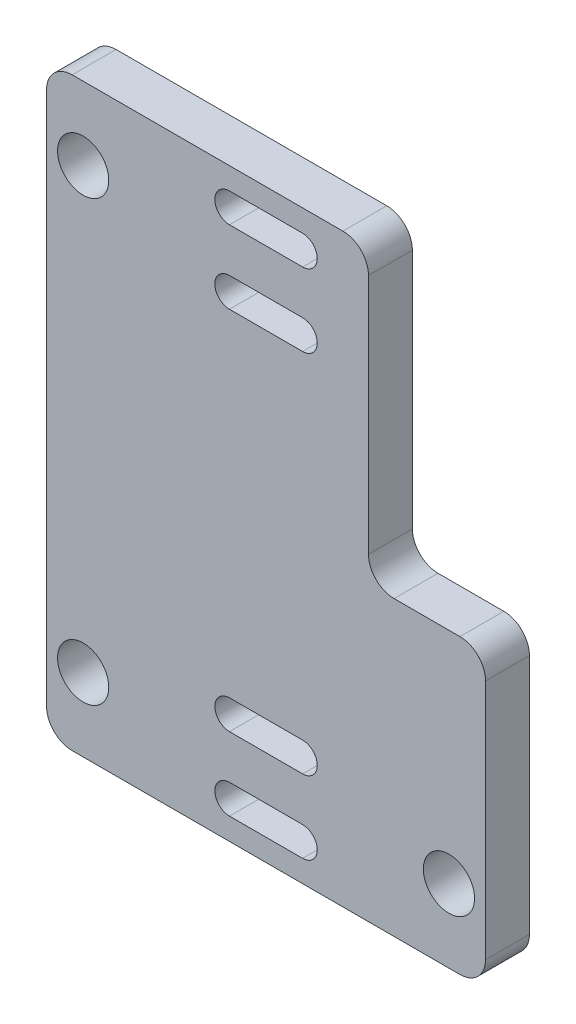
ISO-10303-21;
HEADER;
FILE_DESCRIPTION(('STEP AP214'),'2;1');
FILE_NAME('part.step','',(''),(''),'','','');
FILE_SCHEMA(('AUTOMOTIVE_DESIGN { 1 0 10303 214 1 1 1 1 }'));
ENDSEC;
DATA;
#1=APPLICATION_CONTEXT('core data for automotive mechanical design processes');
#2=APPLICATION_PROTOCOL_DEFINITION('international standard','automotive_design',2000,#1);
#3=PRODUCT_CONTEXT('',#1,'mechanical');
#4=PRODUCT('Part','Part','',(#3));
#5=PRODUCT_RELATED_PRODUCT_CATEGORY('part','',(#4));
#6=PRODUCT_DEFINITION_FORMATION('','',#4);
#7=PRODUCT_DEFINITION_CONTEXT('part definition',#1,'design');
#8=PRODUCT_DEFINITION('design','',#6,#7);
#9=PRODUCT_DEFINITION_SHAPE('','',#8);
#10=(LENGTH_UNIT() NAMED_UNIT(*) SI_UNIT(.MILLI.,.METRE.));
#11=(NAMED_UNIT(*) PLANE_ANGLE_UNIT() SI_UNIT($,.RADIAN.));
#12=(NAMED_UNIT(*) SI_UNIT($,.STERADIAN.) SOLID_ANGLE_UNIT());
#13=UNCERTAINTY_MEASURE_WITH_UNIT(LENGTH_MEASURE(1.E-05),#10,'distance_accuracy_value','');
#14=(GEOMETRIC_REPRESENTATION_CONTEXT(3) GLOBAL_UNCERTAINTY_ASSIGNED_CONTEXT((#13)) GLOBAL_UNIT_ASSIGNED_CONTEXT((#10,
#11,#12)) REPRESENTATION_CONTEXT('',''));
#15=CARTESIAN_POINT('',(0.,0.,0.));
#16=DIRECTION('',(0.,0.,1.));
#17=DIRECTION('',(1.,0.,0.));
#18=AXIS2_PLACEMENT_3D('',#15,#16,#17);
#19=CARTESIAN_POINT('',(0.,13.5,3.));
#20=DIRECTION('',(0.,1.,0.));
#21=DIRECTION('',(0.,0.,1.));
#22=AXIS2_PLACEMENT_3D('',#19,#20,#21);
#23=PLANE('',#22);
#24=DIRECTION('',(1.,0.,0.));
#25=VECTOR('',#24,1.);
#26=CARTESIAN_POINT('',(0.,13.5,0.));
#27=LINE('',#26,#25);
#28=CARTESIAN_POINT('',(-2.49999999999999,13.5,0.));
#29=VERTEX_POINT('',#28);
#30=CARTESIAN_POINT('',(2.5,13.5,0.));
#31=VERTEX_POINT('',#30);
#32=EDGE_CURVE('E372',#29,#31,#27,.T.);
#33=ORIENTED_EDGE('',*,*,#32,.T.);
#34=DIRECTION('',(0.,0.,-1.));
#35=VECTOR('',#34,1.);
#36=CARTESIAN_POINT('',(2.5,13.5,3.));
#37=LINE('',#36,#35);
#38=CARTESIAN_POINT('',(2.5,13.5,3.));
#39=VERTEX_POINT('',#38);
#40=EDGE_CURVE('E390',#39,#31,#37,.T.);
#41=ORIENTED_EDGE('',*,*,#40,.F.);
#42=DIRECTION('',(1.,0.,0.));
#43=VECTOR('',#42,1.);
#44=CARTESIAN_POINT('',(0.,13.5,3.));
#45=LINE('',#44,#43);
#46=CARTESIAN_POINT('',(-2.49999999999999,13.5,3.));
#47=VERTEX_POINT('',#46);
#48=EDGE_CURVE('E302',#47,#39,#45,.T.);
#49=ORIENTED_EDGE('',*,*,#48,.F.);
#50=DIRECTION('',(0.,0.,-1.));
#51=VECTOR('',#50,1.);
#52=CARTESIAN_POINT('',(-2.49999999999999,13.5,3.));
#53=LINE('',#52,#51);
#54=EDGE_CURVE('E382',#47,#29,#53,.T.);
#55=ORIENTED_EDGE('',*,*,#54,.T.);
#56=EDGE_LOOP('',(#33,#41,#49,#55));
#57=FACE_BOUND('',#56,.T.);
#58=ADVANCED_FACE('F39',(#57),#23,.F.);
#59=CARTESIAN_POINT('',(2.5,12.5,3.));
#60=DIRECTION('',(0.,0.,-1.));
#61=DIRECTION('',(-1.,0.,0.));
#62=AXIS2_PLACEMENT_3D('',#59,#60,#61);
#63=CYLINDRICAL_SURFACE('',#62,0.999999999999994);
#64=CARTESIAN_POINT('',(2.5,12.5,0.));
#65=DIRECTION('',(0.,0.,1.));
#66=DIRECTION('',(1.,0.,0.));
#67=AXIS2_PLACEMENT_3D('',#64,#65,#66);
#68=CIRCLE('',#67,0.999999999999994);
#69=CARTESIAN_POINT('',(2.5,11.5,0.));
#70=VERTEX_POINT('',#69);
#71=EDGE_CURVE('E375',#31,#70,#68,.F.);
#72=ORIENTED_EDGE('',*,*,#71,.T.);
#73=DIRECTION('',(0.,0.,-1.));
#74=VECTOR('',#73,1.);
#75=CARTESIAN_POINT('',(2.5,11.5,3.));
#76=LINE('',#75,#74);
#77=CARTESIAN_POINT('',(2.5,11.5,3.));
#78=VERTEX_POINT('',#77);
#79=EDGE_CURVE('E388',#78,#70,#76,.T.);
#80=ORIENTED_EDGE('',*,*,#79,.F.);
#81=CARTESIAN_POINT('',(2.5,12.5,3.));
#82=DIRECTION('',(0.,0.,1.));
#83=DIRECTION('',(1.,0.,0.));
#84=AXIS2_PLACEMENT_3D('',#81,#82,#83);
#85=CIRCLE('',#84,0.999999999999994);
#86=EDGE_CURVE('E305',#39,#78,#85,.F.);
#87=ORIENTED_EDGE('',*,*,#86,.F.);
#88=ORIENTED_EDGE('',*,*,#40,.T.);
#89=EDGE_LOOP('',(#72,#80,#87,#88));
#90=FACE_BOUND('',#89,.T.);
#91=ADVANCED_FACE('F520',(#90),#63,.F.);
#92=CARTESIAN_POINT('',(0.,11.5,3.));
#93=DIRECTION('',(0.,1.,0.));
#94=DIRECTION('',(0.,0.,1.));
#95=AXIS2_PLACEMENT_3D('',#92,#93,#94);
#96=PLANE('',#95);
#97=DIRECTION('',(1.,0.,0.));
#98=VECTOR('',#97,1.);
#99=CARTESIAN_POINT('',(0.,11.5,0.));
#100=LINE('',#99,#98);
#101=CARTESIAN_POINT('',(-2.49999999999999,11.5,0.));
#102=VERTEX_POINT('',#101);
#103=EDGE_CURVE('E378',#102,#70,#100,.T.);
#104=ORIENTED_EDGE('',*,*,#103,.F.);
#105=DIRECTION('',(0.,0.,-1.));
#106=VECTOR('',#105,1.);
#107=CARTESIAN_POINT('',(-2.49999999999999,11.5,3.));
#108=LINE('',#107,#106);
#109=CARTESIAN_POINT('',(-2.49999999999999,11.5,3.));
#110=VERTEX_POINT('',#109);
#111=EDGE_CURVE('E385',#110,#102,#108,.T.);
#112=ORIENTED_EDGE('',*,*,#111,.F.);
#113=DIRECTION('',(1.,0.,0.));
#114=VECTOR('',#113,1.);
#115=CARTESIAN_POINT('',(0.,11.5,3.));
#116=LINE('',#115,#114);
#117=EDGE_CURVE('E307',#110,#78,#116,.T.);
#118=ORIENTED_EDGE('',*,*,#117,.T.);
#119=ORIENTED_EDGE('',*,*,#79,.T.);
#120=EDGE_LOOP('',(#104,#112,#118,#119));
#121=FACE_BOUND('',#120,.T.);
#122=ADVANCED_FACE('F526',(#121),#96,.T.);
#123=CARTESIAN_POINT('',(0.,-16.5,3.));
#124=DIRECTION('',(0.,1.,0.));
#125=DIRECTION('',(0.,0.,1.));
#126=AXIS2_PLACEMENT_3D('',#123,#124,#125);
#127=PLANE('',#126);
#128=DIRECTION('',(1.,0.,0.));
#129=VECTOR('',#128,1.);
#130=CARTESIAN_POINT('',(0.,-16.5,0.));
#131=LINE('',#130,#129);
#132=CARTESIAN_POINT('',(-2.5,-16.5,0.));
#133=VERTEX_POINT('',#132);
#134=CARTESIAN_POINT('',(2.5,-16.5,0.));
#135=VERTEX_POINT('',#134);
#136=EDGE_CURVE('E361',#133,#135,#131,.T.);
#137=ORIENTED_EDGE('',*,*,#136,.T.);
#138=DIRECTION('',(0.,0.,-1.));
#139=VECTOR('',#138,1.);
#140=CARTESIAN_POINT('',(2.5,-16.5,3.));
#141=LINE('',#140,#139);
#142=CARTESIAN_POINT('',(2.5,-16.5,3.));
#143=VERTEX_POINT('',#142);
#144=EDGE_CURVE('E386',#143,#135,#141,.T.);
#145=ORIENTED_EDGE('',*,*,#144,.F.);
#146=DIRECTION('',(1.,0.,0.));
#147=VECTOR('',#146,1.);
#148=CARTESIAN_POINT('',(0.,-16.5,3.));
#149=LINE('',#148,#147);
#150=CARTESIAN_POINT('',(-2.5,-16.5,3.));
#151=VERTEX_POINT('',#150);
#152=EDGE_CURVE('E292',#151,#143,#149,.T.);
#153=ORIENTED_EDGE('',*,*,#152,.F.);
#154=DIRECTION('',(0.,0.,-1.));
#155=VECTOR('',#154,1.);
#156=CARTESIAN_POINT('',(-2.5,-16.5,3.));
#157=LINE('',#156,#155);
#158=EDGE_CURVE('E394',#151,#133,#157,.T.);
#159=ORIENTED_EDGE('',*,*,#158,.T.);
#160=EDGE_LOOP('',(#137,#145,#153,#159));
#161=FACE_BOUND('',#160,.T.);
#162=ADVANCED_FACE('F543',(#161),#127,.F.);
#163=CARTESIAN_POINT('',(2.5,-17.5,3.));
#164=DIRECTION('',(0.,0.,-1.));
#165=DIRECTION('',(-1.,0.,0.));
#166=AXIS2_PLACEMENT_3D('',#163,#164,#165);
#167=CYLINDRICAL_SURFACE('',#166,0.999999999999994);
#168=CARTESIAN_POINT('',(2.5,-17.5,0.));
#169=DIRECTION('',(0.,0.,1.));
#170=DIRECTION('',(1.,0.,0.));
#171=AXIS2_PLACEMENT_3D('',#168,#169,#170);
#172=CIRCLE('',#171,0.999999999999994);
#173=CARTESIAN_POINT('',(2.5,-18.5,0.));
#174=VERTEX_POINT('',#173);
#175=EDGE_CURVE('E364',#135,#174,#172,.F.);
#176=ORIENTED_EDGE('',*,*,#175,.T.);
#177=DIRECTION('',(0.,0.,-1.));
#178=VECTOR('',#177,1.);
#179=CARTESIAN_POINT('',(2.5,-18.5,3.));
#180=LINE('',#179,#178);
#181=CARTESIAN_POINT('',(2.5,-18.5,3.));
#182=VERTEX_POINT('',#181);
#183=EDGE_CURVE('E400',#182,#174,#180,.T.);
#184=ORIENTED_EDGE('',*,*,#183,.F.);
#185=CARTESIAN_POINT('',(2.5,-17.5,3.));
#186=DIRECTION('',(0.,0.,1.));
#187=DIRECTION('',(1.,0.,0.));
#188=AXIS2_PLACEMENT_3D('',#185,#186,#187);
#189=CIRCLE('',#188,0.999999999999994);
#190=EDGE_CURVE('E295',#143,#182,#189,.F.);
#191=ORIENTED_EDGE('',*,*,#190,.F.);
#192=ORIENTED_EDGE('',*,*,#144,.T.);
#193=EDGE_LOOP('',(#176,#184,#191,#192));
#194=FACE_BOUND('',#193,.T.);
#195=ADVANCED_FACE('F539',(#194),#167,.F.);
#196=CARTESIAN_POINT('',(0.,-18.5,3.));
#197=DIRECTION('',(0.,1.,0.));
#198=DIRECTION('',(0.,0.,1.));
#199=AXIS2_PLACEMENT_3D('',#196,#197,#198);
#200=PLANE('',#199);
#201=DIRECTION('',(1.,0.,0.));
#202=VECTOR('',#201,1.);
#203=CARTESIAN_POINT('',(0.,-18.5,0.));
#204=LINE('',#203,#202);
#205=CARTESIAN_POINT('',(-2.5,-18.5,0.));
#206=VERTEX_POINT('',#205);
#207=EDGE_CURVE('E367',#206,#174,#204,.T.);
#208=ORIENTED_EDGE('',*,*,#207,.F.);
#209=DIRECTION('',(0.,0.,-1.));
#210=VECTOR('',#209,1.);
#211=CARTESIAN_POINT('',(-2.5,-18.5,3.));
#212=LINE('',#211,#210);
#213=CARTESIAN_POINT('',(-2.5,-18.5,3.));
#214=VERTEX_POINT('',#213);
#215=EDGE_CURVE('E397',#214,#206,#212,.T.);
#216=ORIENTED_EDGE('',*,*,#215,.F.);
#217=DIRECTION('',(1.,0.,0.));
#218=VECTOR('',#217,1.);
#219=CARTESIAN_POINT('',(0.,-18.5,3.));
#220=LINE('',#219,#218);
#221=EDGE_CURVE('E297',#214,#182,#220,.T.);
#222=ORIENTED_EDGE('',*,*,#221,.T.);
#223=ORIENTED_EDGE('',*,*,#183,.T.);
#224=EDGE_LOOP('',(#208,#216,#222,#223));
#225=FACE_BOUND('',#224,.T.);
#226=ADVANCED_FACE('F536',(#225),#200,.T.);
#227=CARTESIAN_POINT('',(0.,-20.,3.));
#228=DIRECTION('',(0.,1.,0.));
#229=DIRECTION('',(0.,0.,1.));
#230=AXIS2_PLACEMENT_3D('',#227,#228,#229);
#231=PLANE('',#230);
#232=DIRECTION('',(1.,0.,0.));
#233=VECTOR('',#232,1.);
#234=CARTESIAN_POINT('',(0.,-20.,3.));
#235=LINE('',#234,#233);
#236=CARTESIAN_POINT('',(-13.25,-20.,3.));
#237=VERTEX_POINT('',#236);
#238=CARTESIAN_POINT('',(13.25,-20.,3.));
#239=VERTEX_POINT('',#238);
#240=EDGE_CURVE('E275',#237,#239,#235,.T.);
#241=ORIENTED_EDGE('',*,*,#240,.F.);
#242=DIRECTION('',(0.,0.,-1.));
#243=VECTOR('',#242,1.);
#244=CARTESIAN_POINT('',(-13.25,-20.,3.));
#245=LINE('',#244,#243);
#246=CARTESIAN_POINT('',(-13.25,-20.,0.));
#247=VERTEX_POINT('',#246);
#248=EDGE_CURVE('E459',#237,#247,#245,.T.);
#249=ORIENTED_EDGE('',*,*,#248,.T.);
#250=DIRECTION('',(1.,0.,0.));
#251=VECTOR('',#250,1.);
#252=CARTESIAN_POINT('',(0.,-20.,0.));
#253=LINE('',#252,#251);
#254=CARTESIAN_POINT('',(13.25,-20.,0.));
#255=VERTEX_POINT('',#254);
#256=EDGE_CURVE('E343',#247,#255,#253,.T.);
#257=ORIENTED_EDGE('',*,*,#256,.T.);
#258=DIRECTION('',(0.,0.,-1.));
#259=VECTOR('',#258,1.);
#260=CARTESIAN_POINT('',(13.25,-20.,3.));
#261=LINE('',#260,#259);
#262=EDGE_CURVE('E457',#255,#239,#261,.F.);
#263=ORIENTED_EDGE('',*,*,#262,.T.);
#264=EDGE_LOOP('',(#241,#249,#257,#263));
#265=FACE_BOUND('',#264,.T.);
#266=ADVANCED_FACE('F499',(#265),#231,.F.);
#267=CARTESIAN_POINT('',(15.,0.,3.));
#268=DIRECTION('',(-1.,0.,0.));
#269=DIRECTION('',(0.,0.,1.));
#270=AXIS2_PLACEMENT_3D('',#267,#268,#269);
#271=PLANE('',#270);
#272=DIRECTION('',(0.,1.,0.));
#273=VECTOR('',#272,1.);
#274=CARTESIAN_POINT('',(15.,0.,0.));
#275=LINE('',#274,#273);
#276=CARTESIAN_POINT('',(15.,-18.25,0.));
#277=VERTEX_POINT('',#276);
#278=CARTESIAN_POINT('',(15.,-1.75,0.));
#279=VERTEX_POINT('',#278);
#280=EDGE_CURVE('E346',#277,#279,#275,.T.);
#281=ORIENTED_EDGE('',*,*,#280,.T.);
#282=DIRECTION('',(0.,0.,-1.));
#283=VECTOR('',#282,1.);
#284=CARTESIAN_POINT('',(15.,-1.75,3.));
#285=LINE('',#284,#283);
#286=CARTESIAN_POINT('',(15.,-1.75,3.));
#287=VERTEX_POINT('',#286);
#288=EDGE_CURVE('E455',#279,#287,#285,.F.);
#289=ORIENTED_EDGE('',*,*,#288,.T.);
#290=DIRECTION('',(0.,1.,0.));
#291=VECTOR('',#290,1.);
#292=CARTESIAN_POINT('',(15.,0.,3.));
#293=LINE('',#292,#291);
#294=CARTESIAN_POINT('',(15.,-18.25,3.));
#295=VERTEX_POINT('',#294);
#296=EDGE_CURVE('E278',#295,#287,#293,.T.);
#297=ORIENTED_EDGE('',*,*,#296,.F.);
#298=DIRECTION('',(0.,0.,-1.));
#299=VECTOR('',#298,1.);
#300=CARTESIAN_POINT('',(15.,-18.25,3.));
#301=LINE('',#300,#299);
#302=EDGE_CURVE('E452',#295,#277,#301,.T.);
#303=ORIENTED_EDGE('',*,*,#302,.T.);
#304=EDGE_LOOP('',(#281,#289,#297,#303));
#305=FACE_BOUND('',#304,.T.);
#306=ADVANCED_FACE('F507',(#305),#271,.F.);
#307=CARTESIAN_POINT('',(0.,0.,3.));
#308=DIRECTION('',(0.,1.,0.));
#309=DIRECTION('',(0.,0.,1.));
#310=AXIS2_PLACEMENT_3D('',#307,#308,#309);
#311=PLANE('',#310);
#312=DIRECTION('',(1.,0.,0.));
#313=VECTOR('',#312,1.);
#314=CARTESIAN_POINT('',(0.,0.,0.));
#315=LINE('',#314,#313);
#316=CARTESIAN_POINT('',(8.75,0.,0.));
#317=VERTEX_POINT('',#316);
#318=CARTESIAN_POINT('',(13.25,0.,0.));
#319=VERTEX_POINT('',#318);
#320=EDGE_CURVE('E349',#317,#319,#315,.T.);
#321=ORIENTED_EDGE('',*,*,#320,.F.);
#322=DIRECTION('',(0.,0.,-1.));
#323=VECTOR('',#322,1.);
#324=CARTESIAN_POINT('',(8.75,0.,3.));
#325=LINE('',#324,#323);
#326=CARTESIAN_POINT('',(8.75,0.,3.));
#327=VERTEX_POINT('',#326);
#328=EDGE_CURVE('E450',#317,#327,#325,.F.);
#329=ORIENTED_EDGE('',*,*,#328,.T.);
#330=DIRECTION('',(1.,0.,0.));
#331=VECTOR('',#330,1.);
#332=CARTESIAN_POINT('',(0.,0.,3.));
#333=LINE('',#332,#331);
#334=CARTESIAN_POINT('',(13.25,0.,3.));
#335=VERTEX_POINT('',#334);
#336=EDGE_CURVE('E281',#327,#335,#333,.T.);
#337=ORIENTED_EDGE('',*,*,#336,.T.);
#338=DIRECTION('',(0.,0.,-1.));
#339=VECTOR('',#338,1.);
#340=CARTESIAN_POINT('',(13.25,0.,0.));
#341=LINE('',#340,#339);
#342=EDGE_CURVE('E447',#335,#319,#341,.T.);
#343=ORIENTED_EDGE('',*,*,#342,.T.);
#344=EDGE_LOOP('',(#321,#329,#337,#343));
#345=FACE_BOUND('',#344,.T.);
#346=ADVANCED_FACE('F470',(#345),#311,.T.);
#347=CARTESIAN_POINT('',(7.,0.,3.));
#348=DIRECTION('',(1.,0.,0.));
#349=DIRECTION('',(0.,1.,0.));
#350=AXIS2_PLACEMENT_3D('',#347,#348,#349);
#351=PLANE('',#350);
#352=DIRECTION('',(0.,-1.,0.));
#353=VECTOR('',#352,1.);
#354=CARTESIAN_POINT('',(7.,0.,0.));
#355=LINE('',#354,#353);
#356=CARTESIAN_POINT('',(7.,18.25,0.));
#357=VERTEX_POINT('',#356);
#358=CARTESIAN_POINT('',(7.,1.75,0.));
#359=VERTEX_POINT('',#358);
#360=EDGE_CURVE('E352',#357,#359,#355,.T.);
#361=ORIENTED_EDGE('',*,*,#360,.F.);
#362=DIRECTION('',(0.,0.,-1.));
#363=VECTOR('',#362,1.);
#364=CARTESIAN_POINT('',(7.,18.25,3.));
#365=LINE('',#364,#363);
#366=CARTESIAN_POINT('',(7.,18.25,3.));
#367=VERTEX_POINT('',#366);
#368=EDGE_CURVE('E59',#357,#367,#365,.F.);
#369=ORIENTED_EDGE('',*,*,#368,.T.);
#370=DIRECTION('',(0.,-1.,0.));
#371=VECTOR('',#370,1.);
#372=CARTESIAN_POINT('',(7.,0.,3.));
#373=LINE('',#372,#371);
#374=CARTESIAN_POINT('',(7.,1.75,3.));
#375=VERTEX_POINT('',#374);
#376=EDGE_CURVE('E284',#367,#375,#373,.T.);
#377=ORIENTED_EDGE('',*,*,#376,.T.);
#378=DIRECTION('',(0.,0.,-1.));
#379=VECTOR('',#378,1.);
#380=CARTESIAN_POINT('',(7.,1.75,0.));
#381=LINE('',#380,#379);
#382=EDGE_CURVE('E443',#375,#359,#381,.T.);
#383=ORIENTED_EDGE('',*,*,#382,.T.);
#384=EDGE_LOOP('',(#361,#369,#377,#383));
#385=FACE_BOUND('',#384,.T.);
#386=ADVANCED_FACE('F473',(#385),#351,.T.);
#387=CARTESIAN_POINT('',(0.,20.,3.));
#388=DIRECTION('',(0.,1.,0.));
#389=DIRECTION('',(0.,0.,1.));
#390=AXIS2_PLACEMENT_3D('',#387,#388,#389);
#391=PLANE('',#390);
#392=DIRECTION('',(1.,0.,0.));
#393=VECTOR('',#392,1.);
#394=CARTESIAN_POINT('',(0.,20.,0.));
#395=LINE('',#394,#393);
#396=CARTESIAN_POINT('',(-13.25,20.,0.));
#397=VERTEX_POINT('',#396);
#398=CARTESIAN_POINT('',(5.25,20.,0.));
#399=VERTEX_POINT('',#398);
#400=EDGE_CURVE('E355',#397,#399,#395,.T.);
#401=ORIENTED_EDGE('',*,*,#400,.F.);
#402=DIRECTION('',(0.,0.,-1.));
#403=VECTOR('',#402,1.);
#404=CARTESIAN_POINT('',(-13.25,20.,3.));
#405=LINE('',#404,#403);
#406=CARTESIAN_POINT('',(-13.25,20.,3.));
#407=VERTEX_POINT('',#406);
#408=EDGE_CURVE('E431',#397,#407,#405,.F.);
#409=ORIENTED_EDGE('',*,*,#408,.T.);
#410=DIRECTION('',(1.,0.,0.));
#411=VECTOR('',#410,1.);
#412=CARTESIAN_POINT('',(0.,20.,3.));
#413=LINE('',#412,#411);
#414=CARTESIAN_POINT('',(5.25,20.,3.));
#415=VERTEX_POINT('',#414);
#416=EDGE_CURVE('E286',#407,#415,#413,.T.);
#417=ORIENTED_EDGE('',*,*,#416,.T.);
#418=DIRECTION('',(0.,0.,-1.));
#419=VECTOR('',#418,1.);
#420=CARTESIAN_POINT('',(5.25,20.,3.));
#421=LINE('',#420,#419);
#422=EDGE_CURVE('E428',#415,#399,#421,.T.);
#423=ORIENTED_EDGE('',*,*,#422,.T.);
#424=EDGE_LOOP('',(#401,#409,#417,#423));
#425=FACE_BOUND('',#424,.T.);
#426=ADVANCED_FACE('F482',(#425),#391,.T.);
#427=CARTESIAN_POINT('',(2.5,-12.5,3.));
#428=DIRECTION('',(0.,0.,-1.));
#429=DIRECTION('',(-1.,0.,0.));
#430=AXIS2_PLACEMENT_3D('',#427,#428,#429);
#431=CYLINDRICAL_SURFACE('',#430,0.999999999999994);
#432=CARTESIAN_POINT('',(2.5,-12.5,0.));
#433=DIRECTION('',(0.,0.,1.));
#434=DIRECTION('',(1.,0.,0.));
#435=AXIS2_PLACEMENT_3D('',#432,#433,#434);
#436=CIRCLE('',#435,0.999999999999994);
#437=CARTESIAN_POINT('',(2.5,-13.5,0.));
#438=VERTEX_POINT('',#437);
#439=CARTESIAN_POINT('',(2.5,-11.5,0.));
#440=VERTEX_POINT('',#439);
#441=EDGE_CURVE('E322',#438,#440,#436,.T.);
#442=ORIENTED_EDGE('',*,*,#441,.F.);
#443=DIRECTION('',(0.,0.,-1.));
#444=VECTOR('',#443,1.);
#445=CARTESIAN_POINT('',(2.5,-13.5,3.));
#446=LINE('',#445,#444);
#447=CARTESIAN_POINT('',(2.5,-13.5,3.));
#448=VERTEX_POINT('',#447);
#449=EDGE_CURVE('E398',#448,#438,#446,.T.);
#450=ORIENTED_EDGE('',*,*,#449,.F.);
#451=CARTESIAN_POINT('',(2.5,-12.5,3.));
#452=DIRECTION('',(0.,0.,1.));
#453=DIRECTION('',(1.,0.,0.));
#454=AXIS2_PLACEMENT_3D('',#451,#452,#453);
#455=CIRCLE('',#454,0.999999999999994);
#456=CARTESIAN_POINT('',(2.5,-11.5,3.));
#457=VERTEX_POINT('',#456);
#458=EDGE_CURVE('E255',#448,#457,#455,.T.);
#459=ORIENTED_EDGE('',*,*,#458,.T.);
#460=DIRECTION('',(0.,0.,-1.));
#461=VECTOR('',#460,1.);
#462=CARTESIAN_POINT('',(2.5,-11.5,3.));
#463=LINE('',#462,#461);
#464=EDGE_CURVE('E234',#457,#440,#463,.T.);
#465=ORIENTED_EDGE('',*,*,#464,.T.);
#466=EDGE_LOOP('',(#442,#450,#459,#465));
#467=FACE_BOUND('',#466,.T.);
#468=ADVANCED_FACE('F553',(#467),#431,.F.);
#469=CARTESIAN_POINT('',(0.,-13.5,3.));
#470=DIRECTION('',(0.,1.,0.));
#471=DIRECTION('',(0.,0.,1.));
#472=AXIS2_PLACEMENT_3D('',#469,#470,#471);
#473=PLANE('',#472);
#474=DIRECTION('',(1.,0.,0.));
#475=VECTOR('',#474,1.);
#476=CARTESIAN_POINT('',(0.,-13.5,0.));
#477=LINE('',#476,#475);
#478=CARTESIAN_POINT('',(-2.5,-13.5,0.));
#479=VERTEX_POINT('',#478);
#480=EDGE_CURVE('E325',#479,#438,#477,.T.);
#481=ORIENTED_EDGE('',*,*,#480,.F.);
#482=DIRECTION('',(0.,0.,-1.));
#483=VECTOR('',#482,1.);
#484=CARTESIAN_POINT('',(-2.5,-13.5,3.));
#485=LINE('',#484,#483);
#486=CARTESIAN_POINT('',(-2.5,-13.5,3.));
#487=VERTEX_POINT('',#486);
#488=EDGE_CURVE('E407',#487,#479,#485,.T.);
#489=ORIENTED_EDGE('',*,*,#488,.F.);
#490=DIRECTION('',(1.,0.,0.));
#491=VECTOR('',#490,1.);
#492=CARTESIAN_POINT('',(0.,-13.5,3.));
#493=LINE('',#492,#491);
#494=EDGE_CURVE('E258',#487,#448,#493,.T.);
#495=ORIENTED_EDGE('',*,*,#494,.T.);
#496=ORIENTED_EDGE('',*,*,#449,.T.);
#497=EDGE_LOOP('',(#481,#489,#495,#496));
#498=FACE_BOUND('',#497,.T.);
#499=ADVANCED_FACE('F581',(#498),#473,.T.);
#500=CARTESIAN_POINT('',(-2.5,-12.5,3.));
#501=DIRECTION('',(0.,0.,-1.));
#502=DIRECTION('',(-1.,0.,0.));
#503=AXIS2_PLACEMENT_3D('',#500,#501,#502);
#504=CYLINDRICAL_SURFACE('',#503,0.999999999999994);
#505=CARTESIAN_POINT('',(-2.5,-12.5,0.));
#506=DIRECTION('',(0.,0.,1.));
#507=DIRECTION('',(1.,0.,0.));
#508=AXIS2_PLACEMENT_3D('',#505,#506,#507);
#509=CIRCLE('',#508,0.999999999999994);
#510=CARTESIAN_POINT('',(-2.5,-11.5,0.));
#511=VERTEX_POINT('',#510);
#512=EDGE_CURVE('E328',#511,#479,#509,.T.);
#513=ORIENTED_EDGE('',*,*,#512,.F.);
#514=DIRECTION('',(0.,0.,-1.));
#515=VECTOR('',#514,1.);
#516=CARTESIAN_POINT('',(-2.5,-11.5,3.));
#517=LINE('',#516,#515);
#518=CARTESIAN_POINT('',(-2.5,-11.5,3.));
#519=VERTEX_POINT('',#518);
#520=EDGE_CURVE('E405',#519,#511,#517,.T.);
#521=ORIENTED_EDGE('',*,*,#520,.F.);
#522=CARTESIAN_POINT('',(-2.5,-12.5,3.));
#523=DIRECTION('',(0.,0.,1.));
#524=DIRECTION('',(1.,0.,0.));
#525=AXIS2_PLACEMENT_3D('',#522,#523,#524);
#526=CIRCLE('',#525,0.999999999999994);
#527=EDGE_CURVE('E261',#519,#487,#526,.T.);
#528=ORIENTED_EDGE('',*,*,#527,.T.);
#529=ORIENTED_EDGE('',*,*,#488,.T.);
#530=EDGE_LOOP('',(#513,#521,#528,#529));
#531=FACE_BOUND('',#530,.T.);
#532=ADVANCED_FACE('F578',(#531),#504,.F.);
#533=CARTESIAN_POINT('',(2.5,17.5,3.));
#534=DIRECTION('',(0.,0.,-1.));
#535=DIRECTION('',(-1.,0.,0.));
#536=AXIS2_PLACEMENT_3D('',#533,#534,#535);
#537=CYLINDRICAL_SURFACE('',#536,0.999999999999994);
#538=CARTESIAN_POINT('',(2.5,17.5,0.));
#539=DIRECTION('',(0.,0.,1.));
#540=DIRECTION('',(1.,0.,0.));
#541=AXIS2_PLACEMENT_3D('',#538,#539,#540);
#542=CIRCLE('',#541,0.999999999999994);
#543=CARTESIAN_POINT('',(2.5,16.5,0.));
#544=VERTEX_POINT('',#543);
#545=CARTESIAN_POINT('',(2.5,18.5,0.));
#546=VERTEX_POINT('',#545);
#547=EDGE_CURVE('E229',#544,#546,#542,.T.);
#548=ORIENTED_EDGE('',*,*,#547,.F.);
#549=DIRECTION('',(0.,0.,-1.));
#550=VECTOR('',#549,1.);
#551=CARTESIAN_POINT('',(2.5,16.5,3.));
#552=LINE('',#551,#550);
#553=CARTESIAN_POINT('',(2.5,16.5,3.));
#554=VERTEX_POINT('',#553);
#555=EDGE_CURVE('E224',#554,#544,#552,.T.);
#556=ORIENTED_EDGE('',*,*,#555,.F.);
#557=CARTESIAN_POINT('',(2.5,17.5,3.));
#558=DIRECTION('',(0.,0.,1.));
#559=DIRECTION('',(1.,0.,0.));
#560=AXIS2_PLACEMENT_3D('',#557,#558,#559);
#561=CIRCLE('',#560,0.999999999999994);
#562=CARTESIAN_POINT('',(2.5,18.5,3.));
#563=VERTEX_POINT('',#562);
#564=EDGE_CURVE('E227',#554,#563,#561,.T.);
#565=ORIENTED_EDGE('',*,*,#564,.T.);
#566=DIRECTION('',(0.,0.,-1.));
#567=VECTOR('',#566,1.);
#568=CARTESIAN_POINT('',(2.5,18.5,3.));
#569=LINE('',#568,#567);
#570=EDGE_CURVE('E312',#563,#546,#569,.T.);
#571=ORIENTED_EDGE('',*,*,#570,.T.);
#572=EDGE_LOOP('',(#548,#556,#565,#571));
#573=FACE_BOUND('',#572,.T.);
#574=ADVANCED_FACE('F226',(#573),#537,.F.);
#575=CARTESIAN_POINT('',(0.,16.5,3.));
#576=DIRECTION('',(0.,1.,0.));
#577=DIRECTION('',(0.,0.,1.));
#578=AXIS2_PLACEMENT_3D('',#575,#576,#577);
#579=PLANE('',#578);
#580=DIRECTION('',(1.,0.,0.));
#581=VECTOR('',#580,1.);
#582=CARTESIAN_POINT('',(0.,16.5,0.));
#583=LINE('',#582,#581);
#584=CARTESIAN_POINT('',(-2.49999999999999,16.5,0.));
#585=VERTEX_POINT('',#584);
#586=EDGE_CURVE('E314',#585,#544,#583,.T.);
#587=ORIENTED_EDGE('',*,*,#586,.F.);
#588=DIRECTION('',(0.,0.,-1.));
#589=VECTOR('',#588,1.);
#590=CARTESIAN_POINT('',(-2.49999999999999,16.5,3.));
#591=LINE('',#590,#589);
#592=CARTESIAN_POINT('',(-2.49999999999999,16.5,3.));
#593=VERTEX_POINT('',#592);
#594=EDGE_CURVE('E235',#593,#585,#591,.T.);
#595=ORIENTED_EDGE('',*,*,#594,.F.);
#596=DIRECTION('',(1.,0.,0.));
#597=VECTOR('',#596,1.);
#598=CARTESIAN_POINT('',(0.,16.5,3.));
#599=LINE('',#598,#597);
#600=EDGE_CURVE('E242',#593,#554,#599,.T.);
#601=ORIENTED_EDGE('',*,*,#600,.T.);
#602=ORIENTED_EDGE('',*,*,#555,.T.);
#603=EDGE_LOOP('',(#587,#595,#601,#602));
#604=FACE_BOUND('',#603,.T.);
#605=ADVANCED_FACE('F249',(#604),#579,.T.);
#606=CARTESIAN_POINT('',(-2.49999999999999,17.5,3.));
#607=DIRECTION('',(0.,0.,-1.));
#608=DIRECTION('',(-1.,0.,0.));
#609=AXIS2_PLACEMENT_3D('',#606,#607,#608);
#610=CYLINDRICAL_SURFACE('',#609,0.999999999999994);
#611=CARTESIAN_POINT('',(-2.49999999999999,17.5,0.));
#612=DIRECTION('',(0.,0.,1.));
#613=DIRECTION('',(1.,0.,0.));
#614=AXIS2_PLACEMENT_3D('',#611,#612,#613);
#615=CIRCLE('',#614,0.999999999999994);
#616=CARTESIAN_POINT('',(-2.49999999999999,18.5,0.));
#617=VERTEX_POINT('',#616);
#618=EDGE_CURVE('E316',#617,#585,#615,.T.);
#619=ORIENTED_EDGE('',*,*,#618,.F.);
#620=DIRECTION('',(0.,0.,-1.));
#621=VECTOR('',#620,1.);
#622=CARTESIAN_POINT('',(-2.49999999999999,18.5,3.));
#623=LINE('',#622,#621);
#624=CARTESIAN_POINT('',(-2.49999999999999,18.5,3.));
#625=VERTEX_POINT('',#624);
#626=EDGE_CURVE('E411',#625,#617,#623,.T.);
#627=ORIENTED_EDGE('',*,*,#626,.F.);
#628=CARTESIAN_POINT('',(-2.49999999999999,17.5,3.));
#629=DIRECTION('',(0.,0.,1.));
#630=DIRECTION('',(1.,0.,0.));
#631=AXIS2_PLACEMENT_3D('',#628,#629,#630);
#632=CIRCLE('',#631,0.999999999999994);
#633=EDGE_CURVE('E250',#625,#593,#632,.T.);
#634=ORIENTED_EDGE('',*,*,#633,.T.);
#635=ORIENTED_EDGE('',*,*,#594,.T.);
#636=EDGE_LOOP('',(#619,#627,#634,#635));
#637=FACE_BOUND('',#636,.T.);
#638=ADVANCED_FACE('F534',(#637),#610,.F.);
#639=CARTESIAN_POINT('',(-2.5,-17.5,3.));
#640=DIRECTION('',(0.,0.,-1.));
#641=DIRECTION('',(-1.,0.,0.));
#642=AXIS2_PLACEMENT_3D('',#639,#640,#641);
#643=CYLINDRICAL_SURFACE('',#642,0.999999999999994);
#644=CARTESIAN_POINT('',(-2.5,-17.5,0.));
#645=DIRECTION('',(0.,0.,1.));
#646=DIRECTION('',(1.,0.,0.));
#647=AXIS2_PLACEMENT_3D('',#644,#645,#646);
#648=CIRCLE('',#647,0.999999999999994);
#649=EDGE_CURVE('E370',#206,#133,#648,.F.);
#650=ORIENTED_EDGE('',*,*,#649,.T.);
#651=ORIENTED_EDGE('',*,*,#158,.F.);
#652=CARTESIAN_POINT('',(-2.5,-17.5,3.));
#653=DIRECTION('',(0.,0.,1.));
#654=DIRECTION('',(1.,0.,0.));
#655=AXIS2_PLACEMENT_3D('',#652,#653,#654);
#656=CIRCLE('',#655,0.999999999999994);
#657=EDGE_CURVE('E300',#214,#151,#656,.F.);
#658=ORIENTED_EDGE('',*,*,#657,.F.);
#659=ORIENTED_EDGE('',*,*,#215,.T.);
#660=EDGE_LOOP('',(#650,#651,#658,#659));
#661=FACE_BOUND('',#660,.T.);
#662=ADVANCED_FACE('F531',(#661),#643,.F.);
#663=CARTESIAN_POINT('',(-15.,0.,3.));
#664=DIRECTION('',(1.,0.,0.));
#665=DIRECTION('',(0.,1.,0.));
#666=AXIS2_PLACEMENT_3D('',#663,#664,#665);
#667=PLANE('',#666);
#668=DIRECTION('',(0.,-1.,0.));
#669=VECTOR('',#668,1.);
#670=CARTESIAN_POINT('',(-15.,0.,3.));
#671=LINE('',#670,#669);
#672=CARTESIAN_POINT('',(-15.,18.25,3.));
#673=VERTEX_POINT('',#672);
#674=CARTESIAN_POINT('',(-15.,-18.25,3.));
#675=VERTEX_POINT('',#674);
#676=EDGE_CURVE('E289',#673,#675,#671,.T.);
#677=ORIENTED_EDGE('',*,*,#676,.F.);
#678=DIRECTION('',(0.,0.,-1.));
#679=VECTOR('',#678,1.);
#680=CARTESIAN_POINT('',(-15.,18.25,0.));
#681=LINE('',#680,#679);
#682=CARTESIAN_POINT('',(-15.,18.25,0.));
#683=VERTEX_POINT('',#682);
#684=EDGE_CURVE('E415',#673,#683,#681,.T.);
#685=ORIENTED_EDGE('',*,*,#684,.T.);
#686=DIRECTION('',(0.,-1.,0.));
#687=VECTOR('',#686,1.);
#688=CARTESIAN_POINT('',(-15.,0.,0.));
#689=LINE('',#688,#687);
#690=CARTESIAN_POINT('',(-15.,-18.25,0.));
#691=VERTEX_POINT('',#690);
#692=EDGE_CURVE('E358',#683,#691,#689,.T.);
#693=ORIENTED_EDGE('',*,*,#692,.T.);
#694=DIRECTION('',(0.,0.,-1.));
#695=VECTOR('',#694,1.);
#696=CARTESIAN_POINT('',(-15.,-18.25,3.));
#697=LINE('',#696,#695);
#698=EDGE_CURVE('E393',#691,#675,#697,.F.);
#699=ORIENTED_EDGE('',*,*,#698,.T.);
#700=EDGE_LOOP('',(#677,#685,#693,#699));
#701=FACE_BOUND('',#700,.T.);
#702=ADVANCED_FACE('F490',(#701),#667,.F.);
#703=CARTESIAN_POINT('',(-12.5,15.,3.));
#704=DIRECTION('',(0.,0.,-1.));
#705=DIRECTION('',(-1.,0.,0.));
#706=AXIS2_PLACEMENT_3D('',#703,#704,#705);
#707=CYLINDRICAL_SURFACE('',#706,1.75);
#708=CARTESIAN_POINT('',(-12.5,15.,3.));
#709=DIRECTION('',(0.,0.,1.));
#710=DIRECTION('',(1.,0.,0.));
#711=AXIS2_PLACEMENT_3D('',#708,#709,#710);
#712=CIRCLE('',#711,1.75);
#713=CARTESIAN_POINT('',(-10.75,15.,3.));
#714=VERTEX_POINT('',#713);
#715=EDGE_CURVE('E272',#714,#714,#712,.T.);
#716=ORIENTED_EDGE('',*,*,#715,.T.);
#717=EDGE_LOOP('',(#716));
#718=FACE_BOUND('',#717,.T.);
#719=CARTESIAN_POINT('',(-12.5,15.,0.));
#720=DIRECTION('',(0.,0.,1.));
#721=DIRECTION('',(1.,0.,0.));
#722=AXIS2_PLACEMENT_3D('',#719,#720,#721);
#723=CIRCLE('',#722,1.75);
#724=CARTESIAN_POINT('',(-10.75,15.,0.));
#725=VERTEX_POINT('',#724);
#726=EDGE_CURVE('E340',#725,#725,#723,.T.);
#727=ORIENTED_EDGE('',*,*,#726,.F.);
#728=EDGE_LOOP('',(#727));
#729=FACE_BOUND('',#728,.T.);
#730=ADVANCED_FACE('F550',(#718,#729),#707,.F.);
#731=CARTESIAN_POINT('',(-12.5,-15.,3.));
#732=DIRECTION('',(0.,0.,-1.));
#733=DIRECTION('',(-1.,0.,0.));
#734=AXIS2_PLACEMENT_3D('',#731,#732,#733);
#735=CYLINDRICAL_SURFACE('',#734,1.75);
#736=CARTESIAN_POINT('',(-12.5,-15.,3.));
#737=DIRECTION('',(0.,0.,1.));
#738=DIRECTION('',(1.,0.,0.));
#739=AXIS2_PLACEMENT_3D('',#736,#737,#738);
#740=CIRCLE('',#739,1.75);
#741=CARTESIAN_POINT('',(-10.75,-15.,3.));
#742=VERTEX_POINT('',#741);
#743=EDGE_CURVE('E269',#742,#742,#740,.T.);
#744=ORIENTED_EDGE('',*,*,#743,.T.);
#745=EDGE_LOOP('',(#744));
#746=FACE_BOUND('',#745,.T.);
#747=CARTESIAN_POINT('',(-12.5,-15.,0.));
#748=DIRECTION('',(0.,0.,1.));
#749=DIRECTION('',(1.,0.,0.));
#750=AXIS2_PLACEMENT_3D('',#747,#748,#749);
#751=CIRCLE('',#750,1.75);
#752=CARTESIAN_POINT('',(-10.75,-15.,0.));
#753=VERTEX_POINT('',#752);
#754=EDGE_CURVE('E337',#753,#753,#751,.T.);
#755=ORIENTED_EDGE('',*,*,#754,.F.);
#756=EDGE_LOOP('',(#755));
#757=FACE_BOUND('',#756,.T.);
#758=ADVANCED_FACE('F564',(#746,#757),#735,.F.);
#759=CARTESIAN_POINT('',(12.5,-15.,3.));
#760=DIRECTION('',(0.,0.,-1.));
#761=DIRECTION('',(-1.,0.,0.));
#762=AXIS2_PLACEMENT_3D('',#759,#760,#761);
#763=CYLINDRICAL_SURFACE('',#762,1.75);
#764=CARTESIAN_POINT('',(12.5,-15.,3.));
#765=DIRECTION('',(0.,0.,1.));
#766=DIRECTION('',(1.,0.,0.));
#767=AXIS2_PLACEMENT_3D('',#764,#765,#766);
#768=CIRCLE('',#767,1.75);
#769=CARTESIAN_POINT('',(14.25,-15.,3.));
#770=VERTEX_POINT('',#769);
#771=EDGE_CURVE('E266',#770,#770,#768,.T.);
#772=ORIENTED_EDGE('',*,*,#771,.T.);
#773=EDGE_LOOP('',(#772));
#774=FACE_BOUND('',#773,.T.);
#775=CARTESIAN_POINT('',(12.5,-15.,0.));
#776=DIRECTION('',(0.,0.,1.));
#777=DIRECTION('',(1.,0.,0.));
#778=AXIS2_PLACEMENT_3D('',#775,#776,#777);
#779=CIRCLE('',#778,1.75);
#780=CARTESIAN_POINT('',(14.25,-15.,0.));
#781=VERTEX_POINT('',#780);
#782=EDGE_CURVE('E334',#781,#781,#779,.T.);
#783=ORIENTED_EDGE('',*,*,#782,.F.);
#784=EDGE_LOOP('',(#783));
#785=FACE_BOUND('',#784,.T.);
#786=ADVANCED_FACE('F568',(#774,#785),#763,.F.);
#787=CARTESIAN_POINT('',(0.,-11.5,3.));
#788=DIRECTION('',(0.,1.,0.));
#789=DIRECTION('',(0.,0.,1.));
#790=AXIS2_PLACEMENT_3D('',#787,#788,#789);
#791=PLANE('',#790);
#792=DIRECTION('',(1.,0.,0.));
#793=VECTOR('',#792,1.);
#794=CARTESIAN_POINT('',(0.,-11.5,0.));
#795=LINE('',#794,#793);
#796=EDGE_CURVE('E331',#511,#440,#795,.T.);
#797=ORIENTED_EDGE('',*,*,#796,.T.);
#798=ORIENTED_EDGE('',*,*,#464,.F.);
#799=DIRECTION('',(1.,0.,0.));
#800=VECTOR('',#799,1.);
#801=CARTESIAN_POINT('',(0.,-11.5,3.));
#802=LINE('',#801,#800);
#803=EDGE_CURVE('E264',#519,#457,#802,.T.);
#804=ORIENTED_EDGE('',*,*,#803,.F.);
#805=ORIENTED_EDGE('',*,*,#520,.T.);
#806=EDGE_LOOP('',(#797,#798,#804,#805));
#807=FACE_BOUND('',#806,.T.);
#808=ADVANCED_FACE('F572',(#807),#791,.F.);
#809=CARTESIAN_POINT('',(0.,18.5,3.));
#810=DIRECTION('',(0.,1.,0.));
#811=DIRECTION('',(0.,0.,1.));
#812=AXIS2_PLACEMENT_3D('',#809,#810,#811);
#813=PLANE('',#812);
#814=DIRECTION('',(1.,0.,0.));
#815=VECTOR('',#814,1.);
#816=CARTESIAN_POINT('',(0.,18.5,0.));
#817=LINE('',#816,#815);
#818=EDGE_CURVE('E319',#617,#546,#817,.T.);
#819=ORIENTED_EDGE('',*,*,#818,.T.);
#820=ORIENTED_EDGE('',*,*,#570,.F.);
#821=DIRECTION('',(1.,0.,0.));
#822=VECTOR('',#821,1.);
#823=CARTESIAN_POINT('',(0.,18.5,3.));
#824=LINE('',#823,#822);
#825=EDGE_CURVE('E245',#625,#563,#824,.T.);
#826=ORIENTED_EDGE('',*,*,#825,.F.);
#827=ORIENTED_EDGE('',*,*,#626,.T.);
#828=EDGE_LOOP('',(#819,#820,#826,#827));
#829=FACE_BOUND('',#828,.T.);
#830=ADVANCED_FACE('F576',(#829),#813,.F.);
#831=CARTESIAN_POINT('',(-2.49999999999999,12.5,3.));
#832=DIRECTION('',(0.,0.,-1.));
#833=DIRECTION('',(-1.,0.,0.));
#834=AXIS2_PLACEMENT_3D('',#831,#832,#833);
#835=CYLINDRICAL_SURFACE('',#834,0.999999999999994);
#836=CARTESIAN_POINT('',(-2.49999999999999,12.5,0.));
#837=DIRECTION('',(0.,0.,1.));
#838=DIRECTION('',(1.,0.,0.));
#839=AXIS2_PLACEMENT_3D('',#836,#837,#838);
#840=CIRCLE('',#839,0.999999999999994);
#841=EDGE_CURVE('E247',#102,#29,#840,.F.);
#842=ORIENTED_EDGE('',*,*,#841,.T.);
#843=ORIENTED_EDGE('',*,*,#54,.F.);
#844=CARTESIAN_POINT('',(-2.49999999999999,12.5,3.));
#845=DIRECTION('',(0.,0.,1.));
#846=DIRECTION('',(1.,0.,0.));
#847=AXIS2_PLACEMENT_3D('',#844,#845,#846);
#848=CIRCLE('',#847,0.999999999999994);
#849=EDGE_CURVE('E310',#110,#47,#848,.F.);
#850=ORIENTED_EDGE('',*,*,#849,.F.);
#851=ORIENTED_EDGE('',*,*,#111,.T.);
#852=EDGE_LOOP('',(#842,#843,#850,#851));
#853=FACE_BOUND('',#852,.T.);
#854=ADVANCED_FACE('F591',(#853),#835,.F.);
#855=CARTESIAN_POINT('',(0.,0.,3.));
#856=DIRECTION('',(0.,0.,1.));
#857=DIRECTION('',(1.,0.,0.));
#858=AXIS2_PLACEMENT_3D('',#855,#856,#857);
#859=PLANE('',#858);
#860=ORIENTED_EDGE('',*,*,#564,.F.);
#861=ORIENTED_EDGE('',*,*,#600,.F.);
#862=ORIENTED_EDGE('',*,*,#633,.F.);
#863=ORIENTED_EDGE('',*,*,#825,.T.);
#864=EDGE_LOOP('',(#860,#861,#862,#863));
#865=FACE_BOUND('',#864,.T.);
#866=ORIENTED_EDGE('',*,*,#458,.F.);
#867=ORIENTED_EDGE('',*,*,#494,.F.);
#868=ORIENTED_EDGE('',*,*,#527,.F.);
#869=ORIENTED_EDGE('',*,*,#803,.T.);
#870=EDGE_LOOP('',(#866,#867,#868,#869));
#871=FACE_BOUND('',#870,.T.);
#872=ORIENTED_EDGE('',*,*,#771,.F.);
#873=EDGE_LOOP('',(#872));
#874=FACE_BOUND('',#873,.T.);
#875=ORIENTED_EDGE('',*,*,#743,.F.);
#876=EDGE_LOOP('',(#875));
#877=FACE_BOUND('',#876,.T.);
#878=ORIENTED_EDGE('',*,*,#715,.F.);
#879=EDGE_LOOP('',(#878));
#880=FACE_BOUND('',#879,.T.);
#881=ORIENTED_EDGE('',*,*,#416,.F.);
#882=CARTESIAN_POINT('',(-13.25,18.25,3.));
#883=DIRECTION('',(0.,0.,1.));
#884=DIRECTION('',(1.,0.,0.));
#885=AXIS2_PLACEMENT_3D('',#882,#883,#884);
#886=CIRCLE('',#885,1.75);
#887=EDGE_CURVE('E441',#407,#673,#886,.T.);
#888=ORIENTED_EDGE('',*,*,#887,.T.);
#889=ORIENTED_EDGE('',*,*,#676,.T.);
#890=CARTESIAN_POINT('',(-13.25,-18.25,3.));
#891=DIRECTION('',(0.,0.,1.));
#892=DIRECTION('',(1.,0.,0.));
#893=AXIS2_PLACEMENT_3D('',#890,#891,#892);
#894=CIRCLE('',#893,1.75);
#895=EDGE_CURVE('E435',#675,#237,#894,.T.);
#896=ORIENTED_EDGE('',*,*,#895,.T.);
#897=ORIENTED_EDGE('',*,*,#240,.T.);
#898=CARTESIAN_POINT('',(13.25,-18.25,3.));
#899=DIRECTION('',(0.,0.,1.));
#900=DIRECTION('',(1.,0.,0.));
#901=AXIS2_PLACEMENT_3D('',#898,#899,#900);
#902=CIRCLE('',#901,1.75);
#903=EDGE_CURVE('E433',#239,#295,#902,.T.);
#904=ORIENTED_EDGE('',*,*,#903,.T.);
#905=ORIENTED_EDGE('',*,*,#296,.T.);
#906=CARTESIAN_POINT('',(13.25,-1.75,3.));
#907=DIRECTION('',(0.,0.,1.));
#908=DIRECTION('',(1.,0.,0.));
#909=AXIS2_PLACEMENT_3D('',#906,#907,#908);
#910=CIRCLE('',#909,1.75);
#911=EDGE_CURVE('E437',#287,#335,#910,.T.);
#912=ORIENTED_EDGE('',*,*,#911,.T.);
#913=ORIENTED_EDGE('',*,*,#336,.F.);
#914=CARTESIAN_POINT('',(8.75,1.75,3.));
#915=DIRECTION('',(0.,0.,1.));
#916=DIRECTION('',(1.,0.,0.));
#917=AXIS2_PLACEMENT_3D('',#914,#915,#916);
#918=CIRCLE('',#917,1.75);
#919=EDGE_CURVE('E11',#327,#375,#918,.F.);
#920=ORIENTED_EDGE('',*,*,#919,.T.);
#921=ORIENTED_EDGE('',*,*,#376,.F.);
#922=CARTESIAN_POINT('',(5.25,18.25,3.));
#923=DIRECTION('',(0.,0.,1.));
#924=DIRECTION('',(1.,0.,0.));
#925=AXIS2_PLACEMENT_3D('',#922,#923,#924);
#926=CIRCLE('',#925,1.75);
#927=EDGE_CURVE('E439',#367,#415,#926,.T.);
#928=ORIENTED_EDGE('',*,*,#927,.T.);
#929=EDGE_LOOP('',(#881,#888,#889,#896,#897,#904,#905,#912,#913,#920,#921,#928));
#930=FACE_BOUND('',#929,.T.);
#931=ORIENTED_EDGE('',*,*,#152,.T.);
#932=ORIENTED_EDGE('',*,*,#190,.T.);
#933=ORIENTED_EDGE('',*,*,#221,.F.);
#934=ORIENTED_EDGE('',*,*,#657,.T.);
#935=EDGE_LOOP('',(#931,#932,#933,#934));
#936=FACE_BOUND('',#935,.T.);
#937=ORIENTED_EDGE('',*,*,#48,.T.);
#938=ORIENTED_EDGE('',*,*,#86,.T.);
#939=ORIENTED_EDGE('',*,*,#117,.F.);
#940=ORIENTED_EDGE('',*,*,#849,.T.);
#941=EDGE_LOOP('',(#937,#938,#939,#940));
#942=FACE_BOUND('',#941,.T.);
#943=ADVANCED_FACE('F239',(#865,#871,#874,#877,#880,#930,#936,#942),#859,.T.);
#944=CARTESIAN_POINT('',(0.,0.,0.));
#945=DIRECTION('',(0.,0.,1.));
#946=DIRECTION('',(1.,0.,0.));
#947=AXIS2_PLACEMENT_3D('',#944,#945,#946);
#948=PLANE('',#947);
#949=ORIENTED_EDGE('',*,*,#547,.T.);
#950=ORIENTED_EDGE('',*,*,#818,.F.);
#951=ORIENTED_EDGE('',*,*,#618,.T.);
#952=ORIENTED_EDGE('',*,*,#586,.T.);
#953=EDGE_LOOP('',(#949,#950,#951,#952));
#954=FACE_BOUND('',#953,.T.);
#955=ORIENTED_EDGE('',*,*,#441,.T.);
#956=ORIENTED_EDGE('',*,*,#796,.F.);
#957=ORIENTED_EDGE('',*,*,#512,.T.);
#958=ORIENTED_EDGE('',*,*,#480,.T.);
#959=EDGE_LOOP('',(#955,#956,#957,#958));
#960=FACE_BOUND('',#959,.T.);
#961=ORIENTED_EDGE('',*,*,#782,.T.);
#962=EDGE_LOOP('',(#961));
#963=FACE_BOUND('',#962,.T.);
#964=ORIENTED_EDGE('',*,*,#754,.T.);
#965=EDGE_LOOP('',(#964));
#966=FACE_BOUND('',#965,.T.);
#967=ORIENTED_EDGE('',*,*,#726,.T.);
#968=EDGE_LOOP('',(#967));
#969=FACE_BOUND('',#968,.T.);
#970=ORIENTED_EDGE('',*,*,#692,.F.);
#971=CARTESIAN_POINT('',(-13.25,18.25,0.));
#972=DIRECTION('',(0.,0.,1.));
#973=DIRECTION('',(1.,0.,0.));
#974=AXIS2_PLACEMENT_3D('',#971,#972,#973);
#975=CIRCLE('',#974,1.75);
#976=EDGE_CURVE('E426',#683,#397,#975,.F.);
#977=ORIENTED_EDGE('',*,*,#976,.T.);
#978=ORIENTED_EDGE('',*,*,#400,.T.);
#979=CARTESIAN_POINT('',(5.25,18.25,0.));
#980=DIRECTION('',(0.,0.,1.));
#981=DIRECTION('',(1.,0.,0.));
#982=AXIS2_PLACEMENT_3D('',#979,#980,#981);
#983=CIRCLE('',#982,1.75);
#984=EDGE_CURVE('E424',#399,#357,#983,.F.);
#985=ORIENTED_EDGE('',*,*,#984,.T.);
#986=ORIENTED_EDGE('',*,*,#360,.T.);
#987=CARTESIAN_POINT('',(8.75,1.75,0.));
#988=DIRECTION('',(0.,0.,1.));
#989=DIRECTION('',(1.,0.,0.));
#990=AXIS2_PLACEMENT_3D('',#987,#988,#989);
#991=CIRCLE('',#990,1.75);
#992=EDGE_CURVE('E47',#359,#317,#991,.T.);
#993=ORIENTED_EDGE('',*,*,#992,.T.);
#994=ORIENTED_EDGE('',*,*,#320,.T.);
#995=CARTESIAN_POINT('',(13.25,-1.75,0.));
#996=DIRECTION('',(0.,0.,1.));
#997=DIRECTION('',(1.,0.,0.));
#998=AXIS2_PLACEMENT_3D('',#995,#996,#997);
#999=CIRCLE('',#998,1.75);
#1000=EDGE_CURVE('E422',#319,#279,#999,.F.);
#1001=ORIENTED_EDGE('',*,*,#1000,.T.);
#1002=ORIENTED_EDGE('',*,*,#280,.F.);
#1003=CARTESIAN_POINT('',(13.25,-18.25,0.));
#1004=DIRECTION('',(0.,0.,1.));
#1005=DIRECTION('',(1.,0.,0.));
#1006=AXIS2_PLACEMENT_3D('',#1003,#1004,#1005);
#1007=CIRCLE('',#1006,1.75);
#1008=EDGE_CURVE('E418',#277,#255,#1007,.F.);
#1009=ORIENTED_EDGE('',*,*,#1008,.T.);
#1010=ORIENTED_EDGE('',*,*,#256,.F.);
#1011=CARTESIAN_POINT('',(-13.25,-18.25,0.));
#1012=DIRECTION('',(0.,0.,1.));
#1013=DIRECTION('',(1.,0.,0.));
#1014=AXIS2_PLACEMENT_3D('',#1011,#1012,#1013);
#1015=CIRCLE('',#1014,1.75);
#1016=EDGE_CURVE('E420',#247,#691,#1015,.F.);
#1017=ORIENTED_EDGE('',*,*,#1016,.T.);
#1018=EDGE_LOOP('',(#970,#977,#978,#985,#986,#993,#994,#1001,#1002,#1009,#1010,#1017));
#1019=FACE_BOUND('',#1018,.T.);
#1020=ORIENTED_EDGE('',*,*,#136,.F.);
#1021=ORIENTED_EDGE('',*,*,#649,.F.);
#1022=ORIENTED_EDGE('',*,*,#207,.T.);
#1023=ORIENTED_EDGE('',*,*,#175,.F.);
#1024=EDGE_LOOP('',(#1020,#1021,#1022,#1023));
#1025=FACE_BOUND('',#1024,.T.);
#1026=ORIENTED_EDGE('',*,*,#32,.F.);
#1027=ORIENTED_EDGE('',*,*,#841,.F.);
#1028=ORIENTED_EDGE('',*,*,#103,.T.);
#1029=ORIENTED_EDGE('',*,*,#71,.F.);
#1030=EDGE_LOOP('',(#1026,#1027,#1028,#1029));
#1031=FACE_BOUND('',#1030,.T.);
#1032=ADVANCED_FACE('F464',(#954,#960,#963,#966,#969,#1019,#1025,#1031),#948,.F.);
#1033=CARTESIAN_POINT('',(-13.25,18.25,3.));
#1034=DIRECTION('',(0.,0.,1.));
#1035=DIRECTION('',(1.,0.,0.));
#1036=AXIS2_PLACEMENT_3D('',#1033,#1034,#1035);
#1037=CYLINDRICAL_SURFACE('',#1036,1.75);
#1038=ORIENTED_EDGE('',*,*,#887,.F.);
#1039=ORIENTED_EDGE('',*,*,#408,.F.);
#1040=ORIENTED_EDGE('',*,*,#976,.F.);
#1041=ORIENTED_EDGE('',*,*,#684,.F.);
#1042=EDGE_LOOP('',(#1038,#1039,#1040,#1041));
#1043=FACE_BOUND('',#1042,.T.);
#1044=ADVANCED_FACE('F487',(#1043),#1037,.T.);
#1045=CARTESIAN_POINT('',(5.25,18.25,3.));
#1046=DIRECTION('',(0.,0.,-1.));
#1047=DIRECTION('',(-1.,0.,0.));
#1048=AXIS2_PLACEMENT_3D('',#1045,#1046,#1047);
#1049=CYLINDRICAL_SURFACE('',#1048,1.75);
#1050=ORIENTED_EDGE('',*,*,#927,.F.);
#1051=ORIENTED_EDGE('',*,*,#368,.F.);
#1052=ORIENTED_EDGE('',*,*,#984,.F.);
#1053=ORIENTED_EDGE('',*,*,#422,.F.);
#1054=EDGE_LOOP('',(#1050,#1051,#1052,#1053));
#1055=FACE_BOUND('',#1054,.T.);
#1056=ADVANCED_FACE('F479',(#1055),#1049,.T.);
#1057=CARTESIAN_POINT('',(8.75,1.75,3.));
#1058=DIRECTION('',(0.,0.,1.));
#1059=DIRECTION('',(1.,0.,0.));
#1060=AXIS2_PLACEMENT_3D('',#1057,#1058,#1059);
#1061=CYLINDRICAL_SURFACE('',#1060,1.75);
#1062=ORIENTED_EDGE('',*,*,#919,.F.);
#1063=ORIENTED_EDGE('',*,*,#328,.F.);
#1064=ORIENTED_EDGE('',*,*,#992,.F.);
#1065=ORIENTED_EDGE('',*,*,#382,.F.);
#1066=EDGE_LOOP('',(#1062,#1063,#1064,#1065));
#1067=FACE_BOUND('',#1066,.T.);
#1068=ADVANCED_FACE('F472',(#1067),#1061,.F.);
#1069=CARTESIAN_POINT('',(13.25,-1.75,3.));
#1070=DIRECTION('',(0.,0.,1.));
#1071=DIRECTION('',(1.,0.,0.));
#1072=AXIS2_PLACEMENT_3D('',#1069,#1070,#1071);
#1073=CYLINDRICAL_SURFACE('',#1072,1.75);
#1074=ORIENTED_EDGE('',*,*,#911,.F.);
#1075=ORIENTED_EDGE('',*,*,#288,.F.);
#1076=ORIENTED_EDGE('',*,*,#1000,.F.);
#1077=ORIENTED_EDGE('',*,*,#342,.F.);
#1078=EDGE_LOOP('',(#1074,#1075,#1076,#1077));
#1079=FACE_BOUND('',#1078,.T.);
#1080=ADVANCED_FACE('F511',(#1079),#1073,.T.);
#1081=CARTESIAN_POINT('',(-13.25,-18.25,3.));
#1082=DIRECTION('',(0.,0.,-1.));
#1083=DIRECTION('',(-1.,0.,0.));
#1084=AXIS2_PLACEMENT_3D('',#1081,#1082,#1083);
#1085=CYLINDRICAL_SURFACE('',#1084,1.75);
#1086=ORIENTED_EDGE('',*,*,#895,.F.);
#1087=ORIENTED_EDGE('',*,*,#698,.F.);
#1088=ORIENTED_EDGE('',*,*,#1016,.F.);
#1089=ORIENTED_EDGE('',*,*,#248,.F.);
#1090=EDGE_LOOP('',(#1086,#1087,#1088,#1089));
#1091=FACE_BOUND('',#1090,.T.);
#1092=ADVANCED_FACE('F496',(#1091),#1085,.T.);
#1093=CARTESIAN_POINT('',(13.25,-18.25,3.));
#1094=DIRECTION('',(0.,0.,-1.));
#1095=DIRECTION('',(-1.,0.,0.));
#1096=AXIS2_PLACEMENT_3D('',#1093,#1094,#1095);
#1097=CYLINDRICAL_SURFACE('',#1096,1.75);
#1098=ORIENTED_EDGE('',*,*,#903,.F.);
#1099=ORIENTED_EDGE('',*,*,#262,.F.);
#1100=ORIENTED_EDGE('',*,*,#1008,.F.);
#1101=ORIENTED_EDGE('',*,*,#302,.F.);
#1102=EDGE_LOOP('',(#1098,#1099,#1100,#1101));
#1103=FACE_BOUND('',#1102,.T.);
#1104=ADVANCED_FACE('F41',(#1103),#1097,.T.);
#1105=CLOSED_SHELL('',(#58,#91,#122,#162,#195,#226,#266,#306,#346,#386,#426,#468,#499,#532,#574,
#605,#638,#662,#702,#730,#758,#786,#808,#830,#854,#943,#1032,#1044,#1056,#1068,#1080,#1092,#1104));
#1106=MANIFOLD_SOLID_BREP('B2',#1105);
#1107=ADVANCED_BREP_SHAPE_REPRESENTATION('',(#18,#1106),#14);
#1108=SHAPE_DEFINITION_REPRESENTATION(#9,#1107);
ENDSEC;
END-ISO-10303-21;
